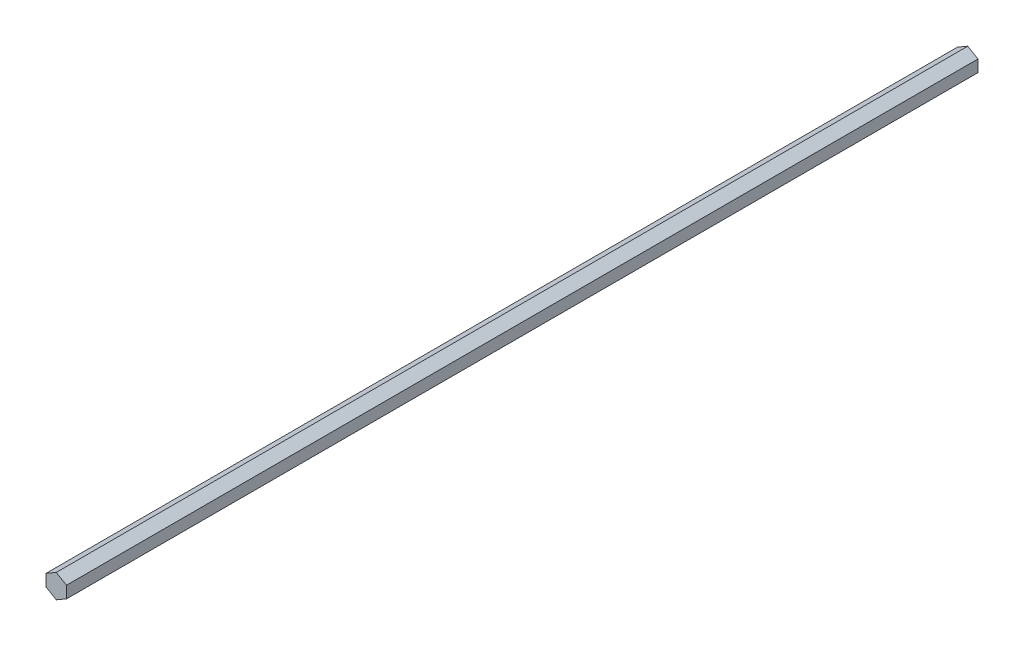
ISO-10303-21;
HEADER;
FILE_DESCRIPTION(('STEP AP214'),'2;1');
FILE_NAME('part.step','',(''),(''),'','','');
FILE_SCHEMA(('AUTOMOTIVE_DESIGN { 1 0 10303 214 1 1 1 1 }'));
ENDSEC;
DATA;
#1=APPLICATION_CONTEXT('core data for automotive mechanical design processes');
#2=APPLICATION_PROTOCOL_DEFINITION('international standard','automotive_design',2000,#1);
#3=PRODUCT_CONTEXT('',#1,'mechanical');
#4=PRODUCT('Part','Part','',(#3));
#5=PRODUCT_RELATED_PRODUCT_CATEGORY('part','',(#4));
#6=PRODUCT_DEFINITION_FORMATION('','',#4);
#7=PRODUCT_DEFINITION_CONTEXT('part definition',#1,'design');
#8=PRODUCT_DEFINITION('design','',#6,#7);
#9=PRODUCT_DEFINITION_SHAPE('','',#8);
#10=(LENGTH_UNIT() NAMED_UNIT(*) SI_UNIT(.MILLI.,.METRE.));
#11=(NAMED_UNIT(*) PLANE_ANGLE_UNIT() SI_UNIT($,.RADIAN.));
#12=(NAMED_UNIT(*) SI_UNIT($,.STERADIAN.) SOLID_ANGLE_UNIT());
#13=UNCERTAINTY_MEASURE_WITH_UNIT(LENGTH_MEASURE(1.E-05),#10,'distance_accuracy_value','');
#14=(GEOMETRIC_REPRESENTATION_CONTEXT(3) GLOBAL_UNCERTAINTY_ASSIGNED_CONTEXT((#13)) GLOBAL_UNIT_ASSIGNED_CONTEXT((#10,
#11,#12)) REPRESENTATION_CONTEXT('',''));
#15=CARTESIAN_POINT('',(0.,0.,0.));
#16=DIRECTION('',(0.,0.,1.));
#17=DIRECTION('',(1.,0.,0.));
#18=AXIS2_PLACEMENT_3D('',#15,#16,#17);
#19=CARTESIAN_POINT('',(-6.35,3.66617420935412,281.94));
#20=DIRECTION('',(0.5,-0.866025403784439,0.));
#21=DIRECTION('',(0.866025403784439,0.5,0.));
#22=AXIS2_PLACEMENT_3D('',#19,#20,#21);
#23=PLANE('',#22);
#24=DIRECTION('',(-0.866025403784439,-0.5,0.));
#25=VECTOR('',#24,1.);
#26=CARTESIAN_POINT('',(-6.35,3.66617420935412,-281.94));
#27=LINE('',#26,#25);
#28=CARTESIAN_POINT('',(0.,7.33234841870825,-281.94));
#29=VERTEX_POINT('',#28);
#30=CARTESIAN_POINT('',(-6.35,3.66617420935412,-281.94));
#31=VERTEX_POINT('',#30);
#32=EDGE_CURVE('E116',#29,#31,#27,.T.);
#33=ORIENTED_EDGE('',*,*,#32,.T.);
#34=DIRECTION('',(0.,0.,-1.));
#35=VECTOR('',#34,1.);
#36=CARTESIAN_POINT('',(-6.35,3.66617420935412,281.94));
#37=LINE('',#36,#35);
#38=CARTESIAN_POINT('',(-6.35,3.66617420935412,281.94));
#39=VERTEX_POINT('',#38);
#40=EDGE_CURVE('E11',#39,#31,#37,.T.);
#41=ORIENTED_EDGE('',*,*,#40,.F.);
#42=DIRECTION('',(-0.866025403784439,-0.5,0.));
#43=VECTOR('',#42,1.);
#44=CARTESIAN_POINT('',(-6.35,3.66617420935412,281.94));
#45=LINE('',#44,#43);
#46=CARTESIAN_POINT('',(0.,7.33234841870825,281.94));
#47=VERTEX_POINT('',#46);
#48=EDGE_CURVE('E126',#47,#39,#45,.T.);
#49=ORIENTED_EDGE('',*,*,#48,.F.);
#50=DIRECTION('',(0.,0.,-1.));
#51=VECTOR('',#50,1.);
#52=CARTESIAN_POINT('',(0.,7.33234841870825,281.94));
#53=LINE('',#52,#51);
#54=EDGE_CURVE('E112',#47,#29,#53,.T.);
#55=ORIENTED_EDGE('',*,*,#54,.T.);
#56=EDGE_LOOP('',(#33,#41,#49,#55));
#57=FACE_BOUND('',#56,.T.);
#58=ADVANCED_FACE('F32',(#57),#23,.F.);
#59=CARTESIAN_POINT('',(-6.35,-3.66617420935412,281.94));
#60=DIRECTION('',(1.,0.,0.));
#61=DIRECTION('',(0.,1.,0.));
#62=AXIS2_PLACEMENT_3D('',#59,#60,#61);
#63=PLANE('',#62);
#64=DIRECTION('',(0.,-1.,0.));
#65=VECTOR('',#64,1.);
#66=CARTESIAN_POINT('',(-6.35,-3.66617420935412,-281.94));
#67=LINE('',#66,#65);
#68=CARTESIAN_POINT('',(-6.35,-3.66617420935412,-281.94));
#69=VERTEX_POINT('',#68);
#70=EDGE_CURVE('E119',#31,#69,#67,.T.);
#71=ORIENTED_EDGE('',*,*,#70,.T.);
#72=DIRECTION('',(0.,0.,-1.));
#73=VECTOR('',#72,1.);
#74=CARTESIAN_POINT('',(-6.35,-3.66617420935412,281.94));
#75=LINE('',#74,#73);
#76=CARTESIAN_POINT('',(-6.35,-3.66617420935412,281.94));
#77=VERTEX_POINT('',#76);
#78=EDGE_CURVE('E40',#77,#69,#75,.T.);
#79=ORIENTED_EDGE('',*,*,#78,.F.);
#80=DIRECTION('',(0.,-1.,0.));
#81=VECTOR('',#80,1.);
#82=CARTESIAN_POINT('',(-6.35,-3.66617420935412,281.94));
#83=LINE('',#82,#81);
#84=EDGE_CURVE('E85',#39,#77,#83,.T.);
#85=ORIENTED_EDGE('',*,*,#84,.F.);
#86=ORIENTED_EDGE('',*,*,#40,.T.);
#87=EDGE_LOOP('',(#71,#79,#85,#86));
#88=FACE_BOUND('',#87,.T.);
#89=ADVANCED_FACE('F150',(#88),#63,.F.);
#90=CARTESIAN_POINT('',(0.,-7.33234841870825,281.94));
#91=DIRECTION('',(0.5,0.866025403784439,0.));
#92=DIRECTION('',(-0.866025403784439,0.5,0.));
#93=AXIS2_PLACEMENT_3D('',#90,#91,#92);
#94=PLANE('',#93);
#95=DIRECTION('',(0.866025403784438,-0.5,0.));
#96=VECTOR('',#95,1.);
#97=CARTESIAN_POINT('',(0.,-7.33234841870825,-281.94));
#98=LINE('',#97,#96);
#99=CARTESIAN_POINT('',(0.,-7.33234841870825,-281.94));
#100=VERTEX_POINT('',#99);
#101=EDGE_CURVE('E121',#69,#100,#98,.T.);
#102=ORIENTED_EDGE('',*,*,#101,.T.);
#103=DIRECTION('',(0.,0.,-1.));
#104=VECTOR('',#103,1.);
#105=CARTESIAN_POINT('',(0.,-7.33234841870825,281.94));
#106=LINE('',#105,#104);
#107=CARTESIAN_POINT('',(0.,-7.33234841870825,281.94));
#108=VERTEX_POINT('',#107);
#109=EDGE_CURVE('E107',#108,#100,#106,.T.);
#110=ORIENTED_EDGE('',*,*,#109,.F.);
#111=DIRECTION('',(0.866025403784438,-0.5,0.));
#112=VECTOR('',#111,1.);
#113=CARTESIAN_POINT('',(0.,-7.33234841870825,281.94));
#114=LINE('',#113,#112);
#115=EDGE_CURVE('E98',#77,#108,#114,.T.);
#116=ORIENTED_EDGE('',*,*,#115,.F.);
#117=ORIENTED_EDGE('',*,*,#78,.T.);
#118=EDGE_LOOP('',(#102,#110,#116,#117));
#119=FACE_BOUND('',#118,.T.);
#120=ADVANCED_FACE('F132',(#119),#94,.F.);
#121=CARTESIAN_POINT('',(6.35,-3.66617420935412,281.94));
#122=DIRECTION('',(-0.5,0.866025403784439,0.));
#123=DIRECTION('',(-0.866025403784439,-0.5,0.));
#124=AXIS2_PLACEMENT_3D('',#121,#122,#123);
#125=PLANE('',#124);
#126=DIRECTION('',(0.866025403784439,0.5,0.));
#127=VECTOR('',#126,1.);
#128=CARTESIAN_POINT('',(6.35,-3.66617420935412,-281.94));
#129=LINE('',#128,#127);
#130=CARTESIAN_POINT('',(6.35,-3.66617420935412,-281.94));
#131=VERTEX_POINT('',#130);
#132=EDGE_CURVE('E106',#100,#131,#129,.T.);
#133=ORIENTED_EDGE('',*,*,#132,.T.);
#134=DIRECTION('',(0.,0.,-1.));
#135=VECTOR('',#134,1.);
#136=CARTESIAN_POINT('',(6.35,-3.66617420935412,281.94));
#137=LINE('',#136,#135);
#138=CARTESIAN_POINT('',(6.35,-3.66617420935412,281.94));
#139=VERTEX_POINT('',#138);
#140=EDGE_CURVE('E103',#139,#131,#137,.T.);
#141=ORIENTED_EDGE('',*,*,#140,.F.);
#142=DIRECTION('',(0.866025403784439,0.5,0.));
#143=VECTOR('',#142,1.);
#144=CARTESIAN_POINT('',(6.35,-3.66617420935412,281.94));
#145=LINE('',#144,#143);
#146=EDGE_CURVE('E92',#108,#139,#145,.T.);
#147=ORIENTED_EDGE('',*,*,#146,.F.);
#148=ORIENTED_EDGE('',*,*,#109,.T.);
#149=EDGE_LOOP('',(#133,#141,#147,#148));
#150=FACE_BOUND('',#149,.T.);
#151=ADVANCED_FACE('F104',(#150),#125,.F.);
#152=CARTESIAN_POINT('',(6.35,3.66617420935412,281.94));
#153=DIRECTION('',(-1.,0.,0.));
#154=DIRECTION('',(0.,-1.,0.));
#155=AXIS2_PLACEMENT_3D('',#152,#153,#154);
#156=PLANE('',#155);
#157=DIRECTION('',(0.,1.,0.));
#158=VECTOR('',#157,1.);
#159=CARTESIAN_POINT('',(6.35,3.66617420935412,-281.94));
#160=LINE('',#159,#158);
#161=CARTESIAN_POINT('',(6.35,3.66617420935412,-281.94));
#162=VERTEX_POINT('',#161);
#163=EDGE_CURVE('E71',#131,#162,#160,.T.);
#164=ORIENTED_EDGE('',*,*,#163,.T.);
#165=DIRECTION('',(0.,0.,-1.));
#166=VECTOR('',#165,1.);
#167=CARTESIAN_POINT('',(6.35,3.66617420935412,281.94));
#168=LINE('',#167,#166);
#169=CARTESIAN_POINT('',(6.35,3.66617420935412,281.94));
#170=VERTEX_POINT('',#169);
#171=EDGE_CURVE('E108',#170,#162,#168,.T.);
#172=ORIENTED_EDGE('',*,*,#171,.F.);
#173=DIRECTION('',(0.,1.,0.));
#174=VECTOR('',#173,1.);
#175=CARTESIAN_POINT('',(6.35,3.66617420935412,281.94));
#176=LINE('',#175,#174);
#177=EDGE_CURVE('E96',#139,#170,#176,.T.);
#178=ORIENTED_EDGE('',*,*,#177,.F.);
#179=ORIENTED_EDGE('',*,*,#140,.T.);
#180=EDGE_LOOP('',(#164,#172,#178,#179));
#181=FACE_BOUND('',#180,.T.);
#182=ADVANCED_FACE('F110',(#181),#156,.F.);
#183=CARTESIAN_POINT('',(0.,7.33234841870825,281.94));
#184=DIRECTION('',(-0.5,-0.866025403784439,0.));
#185=DIRECTION('',(0.866025403784439,-0.5,0.));
#186=AXIS2_PLACEMENT_3D('',#183,#184,#185);
#187=PLANE('',#186);
#188=DIRECTION('',(-0.866025403784439,0.5,0.));
#189=VECTOR('',#188,1.);
#190=CARTESIAN_POINT('',(0.,7.33234841870825,-281.94));
#191=LINE('',#190,#189);
#192=EDGE_CURVE('E77',#162,#29,#191,.T.);
#193=ORIENTED_EDGE('',*,*,#192,.T.);
#194=ORIENTED_EDGE('',*,*,#54,.F.);
#195=DIRECTION('',(-0.866025403784439,0.5,0.));
#196=VECTOR('',#195,1.);
#197=CARTESIAN_POINT('',(0.,7.33234841870825,281.94));
#198=LINE('',#197,#196);
#199=EDGE_CURVE('E48',#170,#47,#198,.T.);
#200=ORIENTED_EDGE('',*,*,#199,.F.);
#201=ORIENTED_EDGE('',*,*,#171,.T.);
#202=EDGE_LOOP('',(#193,#194,#200,#201));
#203=FACE_BOUND('',#202,.T.);
#204=ADVANCED_FACE('F139',(#203),#187,.F.);
#205=CARTESIAN_POINT('',(0.,0.,281.94));
#206=DIRECTION('',(0.,0.,-1.));
#207=DIRECTION('',(-1.,0.,0.));
#208=AXIS2_PLACEMENT_3D('',#205,#206,#207);
#209=PLANE('',#208);
#210=ORIENTED_EDGE('',*,*,#48,.T.);
#211=ORIENTED_EDGE('',*,*,#84,.T.);
#212=ORIENTED_EDGE('',*,*,#115,.T.);
#213=ORIENTED_EDGE('',*,*,#146,.T.);
#214=ORIENTED_EDGE('',*,*,#177,.T.);
#215=ORIENTED_EDGE('',*,*,#199,.T.);
#216=EDGE_LOOP('',(#210,#211,#212,#213,#214,#215));
#217=FACE_BOUND('',#216,.T.);
#218=ADVANCED_FACE('F94',(#217),#209,.F.);
#219=CARTESIAN_POINT('',(0.,0.,-281.94));
#220=DIRECTION('',(0.,0.,-1.));
#221=DIRECTION('',(-1.,0.,0.));
#222=AXIS2_PLACEMENT_3D('',#219,#220,#221);
#223=PLANE('',#222);
#224=ORIENTED_EDGE('',*,*,#32,.F.);
#225=ORIENTED_EDGE('',*,*,#192,.F.);
#226=ORIENTED_EDGE('',*,*,#163,.F.);
#227=ORIENTED_EDGE('',*,*,#132,.F.);
#228=ORIENTED_EDGE('',*,*,#101,.F.);
#229=ORIENTED_EDGE('',*,*,#70,.F.);
#230=EDGE_LOOP('',(#224,#225,#226,#227,#228,#229));
#231=FACE_BOUND('',#230,.T.);
#232=ADVANCED_FACE('F135',(#231),#223,.T.);
#233=CLOSED_SHELL('',(#58,#89,#120,#151,#182,#204,#218,#232));
#234=MANIFOLD_SOLID_BREP('B2',#233);
#235=ADVANCED_BREP_SHAPE_REPRESENTATION('',(#18,#234),#14);
#236=SHAPE_DEFINITION_REPRESENTATION(#9,#235);
ENDSEC;
END-ISO-10303-21;
